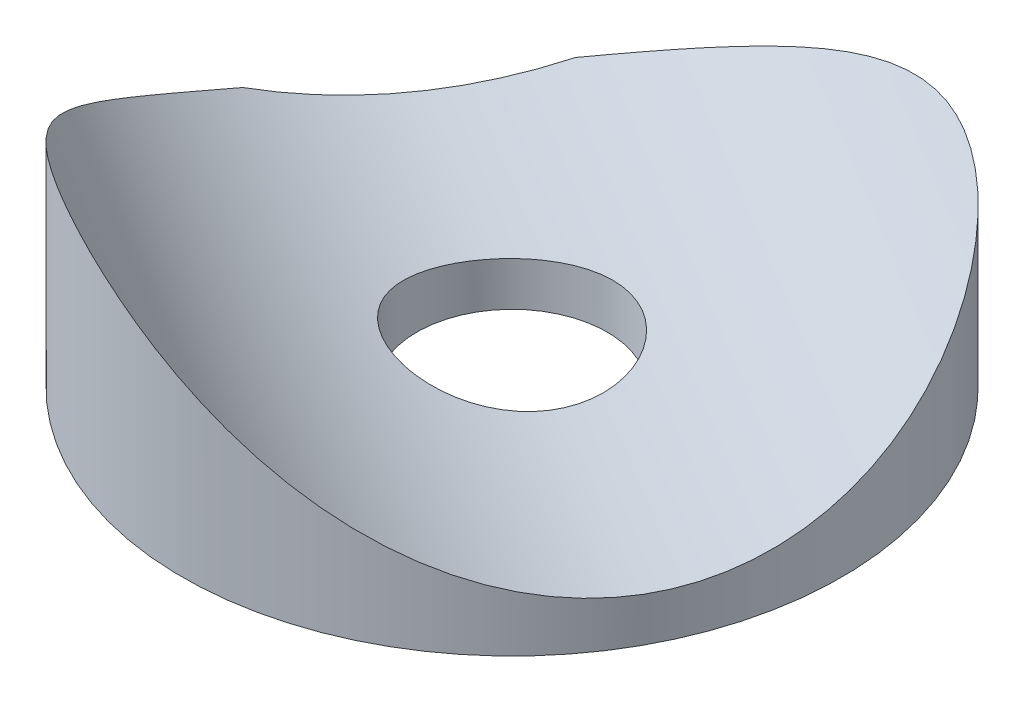
ISO-10303-21;
HEADER;
FILE_DESCRIPTION(('STEP AP214'),'2;1');
FILE_NAME('part.step','',(''),(''),'','','');
FILE_SCHEMA(('AUTOMOTIVE_DESIGN { 1 0 10303 214 1 1 1 1 }'));
ENDSEC;
DATA;
#1=APPLICATION_CONTEXT('core data for automotive mechanical design processes');
#2=APPLICATION_PROTOCOL_DEFINITION('international standard','automotive_design',2000,#1);
#3=PRODUCT_CONTEXT('',#1,'mechanical');
#4=PRODUCT('Part','Part','',(#3));
#5=PRODUCT_RELATED_PRODUCT_CATEGORY('part','',(#4));
#6=PRODUCT_DEFINITION_FORMATION('','',#4);
#7=PRODUCT_DEFINITION_CONTEXT('part definition',#1,'design');
#8=PRODUCT_DEFINITION('design','',#6,#7);
#9=PRODUCT_DEFINITION_SHAPE('','',#8);
#10=(LENGTH_UNIT() NAMED_UNIT(*) SI_UNIT(.MILLI.,.METRE.));
#11=(NAMED_UNIT(*) PLANE_ANGLE_UNIT() SI_UNIT($,.RADIAN.));
#12=(NAMED_UNIT(*) SI_UNIT($,.STERADIAN.) SOLID_ANGLE_UNIT());
#13=UNCERTAINTY_MEASURE_WITH_UNIT(LENGTH_MEASURE(1.E-05),#10,'distance_accuracy_value','');
#14=(GEOMETRIC_REPRESENTATION_CONTEXT(3) GLOBAL_UNCERTAINTY_ASSIGNED_CONTEXT((#13)) GLOBAL_UNIT_ASSIGNED_CONTEXT((#10,
#11,#12)) REPRESENTATION_CONTEXT('',''));
#15=CARTESIAN_POINT('',(0.,0.,0.));
#16=DIRECTION('',(0.,0.,1.));
#17=DIRECTION('',(1.,0.,0.));
#18=AXIS2_PLACEMENT_3D('',#15,#16,#17);
#19=CARTESIAN_POINT('',(0.,1.,0.));
#20=DIRECTION('',(0.,-1.,0.));
#21=DIRECTION('',(0.,0.,-1.));
#22=AXIS2_PLACEMENT_3D('',#19,#20,#21);
#23=CYLINDRICAL_SURFACE('',#22,9.525);
#24=CARTESIAN_POINT('',(0.,0.,0.));
#25=DIRECTION('',(0.,1.,0.));
#26=DIRECTION('',(0.,0.,1.));
#27=AXIS2_PLACEMENT_3D('',#24,#25,#26);
#28=CIRCLE('',#27,9.525);
#29=CARTESIAN_POINT('',(-9.38893175942103,0.,-1.6042398252553));
#30=VERTEX_POINT('',#29);
#31=CARTESIAN_POINT('',(-5.7570076227299,0.,-7.58831260767701));
#32=VERTEX_POINT('',#31);
#33=EDGE_CURVE('E48',#30,#32,#28,.T.);
#34=ORIENTED_EDGE('',*,*,#33,.T.);
#35=DIRECTION('',(0.,1.,0.));
#36=VECTOR('',#35,1.);
#37=CARTESIAN_POINT('',(-5.7570076227299,0.,-7.58831260767701));
#38=LINE('',#37,#36);
#39=CARTESIAN_POINT('',(-5.75700762272995,1.57357757625915,-7.58831260767704));
#40=VERTEX_POINT('',#39);
#41=EDGE_CURVE('E65',#32,#40,#38,.T.);
#42=ORIENTED_EDGE('',*,*,#41,.T.);
#43=CARTESIAN_POINT('',(0.,3.6506814174177,-9.525));
#44=CARTESIAN_POINT('',(0.22237909048093,3.733452678494,-9.52500034706546));
#45=CARTESIAN_POINT('',(0.445378660546458,3.81461579377186,-9.5172159876102));
#46=CARTESIAN_POINT('',(0.892178109928734,3.97181857019409,-9.48576909084998));
#47=CARTESIAN_POINT('',(1.11597827185463,4.04785618425951,-9.46210025029206));
#48=CARTESIAN_POINT('',(1.56398647428124,4.19276272755659,-9.39844823182042));
#49=CARTESIAN_POINT('',(1.78819463015935,4.26162093698106,-9.35844108445317));
#50=CARTESIAN_POINT('',(2.2356623762194,4.38970656675308,-9.26173815261623));
#51=CARTESIAN_POINT('',(2.45892242675594,4.44893935148342,-9.20505171360457));
#52=CARTESIAN_POINT('',(2.90603365144995,4.55609576120154,-9.07389118642197));
#53=CARTESIAN_POINT('',(3.12985989098693,4.60387547115162,-8.99921222798601));
#54=CARTESIAN_POINT('',(3.57364407860214,4.68488536422006,-8.8323758822077));
#55=CARTESIAN_POINT('',(3.79360215508769,4.71811603118604,-8.74021907626035));
#56=CARTESIAN_POINT('',(4.2270093763011,4.76812593471324,-8.53902543880597));
#57=CARTESIAN_POINT('',(4.44047224128782,4.78494257685117,-8.43002764612762));
#58=CARTESIAN_POINT('',(4.8590394857365,4.8012297593004,-8.19590335479795));
#59=CARTESIAN_POINT('',(5.06414518641639,4.80070305222886,-8.07077941871725));
#60=CARTESIAN_POINT('',(5.4333607061631,4.78375549217292,-7.82595558546464));
#61=CARTESIAN_POINT('',(5.59896346666445,4.76976247064538,-7.70832159450795));
#62=CARTESIAN_POINT('',(5.92147144927301,4.72996177680787,-7.46343108435357));
#63=CARTESIAN_POINT('',(6.07837402256478,4.70415052828175,-7.33617166222143));
#64=CARTESIAN_POINT('',(6.38271610075956,4.64172229189515,-7.07298282388013));
#65=CARTESIAN_POINT('',(6.53014555361239,4.60509404922601,-6.93704449353435));
#66=CARTESIAN_POINT('',(6.81488219768711,4.52235744531086,-6.65754024993715));
#67=CARTESIAN_POINT('',(6.95218337122211,4.47624350883152,-6.51396988791492));
#68=CARTESIAN_POINT('',(7.25811511525602,4.36012987577854,-6.17357628743771));
#69=CARTESIAN_POINT('',(7.42289578436665,4.28719080892501,-5.97428832987823));
#70=CARTESIAN_POINT('',(7.73401212509885,4.13079433482259,-5.56567019095694));
#71=CARTESIAN_POINT('',(7.88034064314727,4.04733287314991,-5.35633615806365));
#72=CARTESIAN_POINT('',(8.15470981056013,3.87295689197122,-4.9285876165221));
#73=CARTESIAN_POINT('',(8.28272692697576,3.78203301401353,-4.71016188062345));
#74=CARTESIAN_POINT('',(8.52030625242976,3.59569475789344,-4.26539247396375));
#75=CARTESIAN_POINT('',(8.6298699560098,3.50028074418864,-4.03904944621897));
#76=CARTESIAN_POINT('',(8.83284627685265,3.30530463670498,-3.57383929429456));
#77=CARTESIAN_POINT('',(8.92582974360464,3.20569760788886,-3.33480387967768));
#78=CARTESIAN_POINT('',(9.09229502749264,3.00695749961978,-2.84982866665909));
#79=CARTESIAN_POINT('',(9.16577592138118,2.9078244428226,-2.60388854199917));
#80=CARTESIAN_POINT('',(9.29280555673236,2.71244077825675,-2.10602333245941));
#81=CARTESIAN_POINT('',(9.34637031520592,2.61618791171262,-1.8541032310461));
#82=CARTESIAN_POINT('',(9.43310199315825,2.42870734073609,-1.34494660046395));
#83=CARTESIAN_POINT('',(9.46627168692592,2.33747895437414,-1.08771079929883));
#84=CARTESIAN_POINT('',(9.50955206491735,2.16995418710134,-0.591915382603216));
#85=CARTESIAN_POINT('',(9.52144302627834,2.0930508012756,-0.353716641702909));
#86=CARTESIAN_POINT('',(9.52718529060547,1.94684829681261,0.125113773500827));
#87=CARTESIAN_POINT('',(9.52104599018335,1.87754523673548,0.365744115413936));
#88=CARTESIAN_POINT('',(9.49023009219835,1.74807562735335,0.84829118917853));
#89=CARTESIAN_POINT('',(9.4655541630631,1.68790874869326,1.09020787433238));
#90=CARTESIAN_POINT('',(9.39725359476562,1.57821699516667,1.57380854666545));
#91=CARTESIAN_POINT('',(9.35362900245173,1.52869209398956,1.81549253441851));
#92=CARTESIAN_POINT('',(9.2468116506475,1.44134470549369,2.29864295079791));
#93=CARTESIAN_POINT('',(9.18347392745661,1.40361320401421,2.54009401935461));
#94=CARTESIAN_POINT('',(9.03741073939083,1.34158179009402,3.01885030104931));
#95=CARTESIAN_POINT('',(8.95468511569913,1.31728198768513,3.25615548020898));
#96=CARTESIAN_POINT('',(8.77034965671094,1.28305270781928,3.72422003591037));
#97=CARTESIAN_POINT('',(8.66875202768035,1.27311397800467,3.95498353298807));
#98=CARTESIAN_POINT('',(8.44749114693444,1.26813613835543,4.40783414961075));
#99=CARTESIAN_POINT('',(8.32783011991501,1.27309519512261,4.62992233337697));
#100=CARTESIAN_POINT('',(8.08789173108999,1.29645824482825,5.03587196191596));
#101=CARTESIAN_POINT('',(7.96960287315102,1.31308414836339,5.22101768057337));
#102=CARTESIAN_POINT('',(7.72123078388721,1.35761606789838,5.58177080894418));
#103=CARTESIAN_POINT('',(7.59114874785823,1.38552094170908,5.7573791824353));
#104=CARTESIAN_POINT('',(7.32034519395255,1.45220339144303,6.09799295159335));
#105=CARTESIAN_POINT('',(7.17962354409064,1.4909811022608,6.26299821568092));
#106=CARTESIAN_POINT('',(6.88876339677229,1.5788067465418,6.58157218907568));
#107=CARTESIAN_POINT('',(6.73862447338407,1.62785514477063,6.73514038040992));
#108=CARTESIAN_POINT('',(6.42970367468719,1.73562913110676,7.03067358853535));
#109=CARTESIAN_POINT('',(6.27089719828316,1.79438333781747,7.17260237568541));
#110=CARTESIAN_POINT('',(5.94618463755025,1.92062333472038,7.44401185020723));
#111=CARTESIAN_POINT('',(5.78027582377378,1.98811250231212,7.57348768867714));
#112=CARTESIAN_POINT('',(5.44251585252767,2.13087691541917,7.81973962082222));
#113=CARTESIAN_POINT('',(5.27066481873349,2.206151998951,7.93651597860235));
#114=CARTESIAN_POINT('',(4.92197812629002,2.3635397586242,8.15735023810444));
#115=CARTESIAN_POINT('',(4.74514151071915,2.44565375340315,8.26140567746623));
#116=CARTESIAN_POINT('',(4.31381915110247,2.65071186421033,8.49701730634487));
#117=CARTESIAN_POINT('',(4.05727813244352,2.77657146242391,8.62231021389749));
#118=CARTESIAN_POINT('',(3.53791345362358,3.03730293284649,8.84810949511277));
#119=CARTESIAN_POINT('',(3.27508761733146,3.17217795655747,8.94860714295283));
#120=CARTESIAN_POINT('',(2.74396155309675,3.44858295781127,9.1255054949139));
#121=CARTESIAN_POINT('',(2.47564897446842,3.59012917296496,9.20184350199571));
#122=CARTESIAN_POINT('',(1.93525003180599,3.87676105424118,9.33046531137728));
#123=CARTESIAN_POINT('',(1.66316412956847,4.02184628886322,9.38275203088317));
#124=CARTESIAN_POINT('',(1.11176365251241,4.31474926070324,9.46405917404022));
#125=CARTESIAN_POINT('',(0.832401614462931,4.46257580785578,9.49272618123314));
#126=CARTESIAN_POINT('',(0.270620806169236,4.75535713873259,9.5253137168947));
#127=CARTESIAN_POINT('',(-0.011798853198519,4.90031105044458,9.52922684243904));
#128=CARTESIAN_POINT('',(-0.578823309456278,5.18269507404288,9.51161520991849));
#129=CARTESIAN_POINT('',(-0.863421125866201,5.32014261845171,9.49015226378016));
#130=CARTESIAN_POINT('',(-1.43497221225356,5.58237916760316,9.42068822496332));
#131=CARTESIAN_POINT('',(-1.72192343677743,5.70717811797209,9.37270817737066));
#132=CARTESIAN_POINT('',(-2.33982186606084,5.95413079638297,9.23929042182607));
#133=CARTESIAN_POINT('',(-2.67110514088122,6.07326698198325,9.149424026913));
#134=CARTESIAN_POINT('',(-3.16652150547122,6.22295675517261,8.98493345593029));
#135=CARTESIAN_POINT('',(-3.33131545477155,6.26800018760398,8.92519722094702));
#136=CARTESIAN_POINT('',(-3.65961344271974,6.3467944312253,8.7956778474335));
#137=CARTESIAN_POINT('',(-3.82311810864075,6.38055111325733,8.72589995920701));
#138=CARTESIAN_POINT('',(-4.14960287525218,6.4356233390429,8.57549375030731));
#139=CARTESIAN_POINT('',(-4.31255472816974,6.45678952892885,8.49474860895594));
#140=CARTESIAN_POINT('',(-4.63450087969504,6.48497913175298,8.32347650404684));
#141=CARTESIAN_POINT('',(-4.79349547894325,6.49200362232337,8.2329502863851));
#142=CARTESIAN_POINT('',(-5.10599248219772,6.49152681859125,8.04287958822367));
#143=CARTESIAN_POINT('',(-5.25949451812687,6.48402455264656,7.94333450490919));
#144=CARTESIAN_POINT('',(-5.55960807489611,6.4549041358305,7.73625474625245));
#145=CARTESIAN_POINT('',(-5.70621886425581,6.43328449006229,7.62871922586736));
#146=CARTESIAN_POINT('',(-6.00175711490564,6.37500136712914,7.39878778002419));
#147=CARTESIAN_POINT('',(-6.15009319686921,6.33736798617528,7.27587930902499));
#148=CARTESIAN_POINT('',(-6.4368579960583,6.24907351428848,7.02346192329461));
#149=CARTESIAN_POINT('',(-6.57528544738272,6.19841076254069,6.89395216880626));
#150=CARTESIAN_POINT('',(-6.97591710569875,6.02984978313954,6.49645185009399));
#151=CARTESIAN_POINT('',(-7.22290265355389,5.89550558627119,6.21993774392456));
#152=CARTESIAN_POINT('',(-7.62202096296865,5.63517184863642,5.71900346110004));
#153=CARTESIAN_POINT('',(-7.78266855256773,5.51497057559286,5.49808727197862));
#154=CARTESIAN_POINT('',(-8.08224298694304,5.26415387534452,5.04738956838241));
#155=CARTESIAN_POINT('',(-8.22115853132667,5.13353308306772,4.8176035186019));
#156=CARTESIAN_POINT('',(-8.47806602595574,4.86617462093962,4.34964248978896));
#157=CARTESIAN_POINT('',(-8.5960310256615,4.72942935159897,4.11145717113467));
#158=CARTESIAN_POINT('',(-8.81125052566926,4.45350434616347,3.62734435139673));
#159=CARTESIAN_POINT('',(-8.90850853916985,4.31432502737856,3.38141817178675));
#160=CARTESIAN_POINT('',(-9.08616050605041,4.03035752776154,2.87114292225067));
#161=CARTESIAN_POINT('',(-9.16562839334625,3.88559090303486,2.60645882743807));
#162=CARTESIAN_POINT('',(-9.30161662854024,3.59952186340864,2.06936851111632));
#163=CARTESIAN_POINT('',(-9.35813427298582,3.45821985846934,1.79696138390389));
#164=CARTESIAN_POINT('',(-9.44732893718526,3.18206811661624,1.24557927539444));
#165=CARTESIAN_POINT('',(-9.48004333216279,3.04720857641793,0.966615303675754));
#166=CARTESIAN_POINT('',(-9.52067353055724,2.78640578788668,0.402785560085591));
#167=CARTESIAN_POINT('',(-9.52859584268432,2.6604602078436,0.117921356984621));
#168=CARTESIAN_POINT('',(-9.51944687371087,2.44482112624523,-0.397273669881496));
#169=CARTESIAN_POINT('',(-9.50717023010757,2.35299156531163,-0.62680128201583));
#170=CARTESIAN_POINT('',(-9.46553000057533,2.17801120293598,-1.0875924783347));
#171=CARTESIAN_POINT('',(-9.43617008765357,2.09485854043875,-1.31885567880982));
#172=CARTESIAN_POINT('',(-9.35979851702589,1.93858211671128,-1.78179977177871));
#173=CARTESIAN_POINT('',(-9.31279247294793,1.8654551761647,-2.01348050814312));
#174=CARTESIAN_POINT('',(-9.20068933572693,1.73048167956561,-2.47578349833277));
#175=CARTESIAN_POINT('',(-9.13559202468938,1.6686352593926,-2.70640573937529));
#176=CARTESIAN_POINT('',(-8.98653717823234,1.55697423821467,-3.16649271546125));
#177=CARTESIAN_POINT('',(-8.90244182756762,1.5072533730385,-3.39593579018033));
#178=CARTESIAN_POINT('',(-8.71577157367619,1.42144072912138,-3.84982549130898));
#179=CARTESIAN_POINT('',(-8.61319659163794,1.38534900850775,-4.07427209640511));
#180=CARTESIAN_POINT('',(-8.39010466963368,1.32751107740255,-4.5158528291067));
#181=CARTESIAN_POINT('',(-8.26959675782085,1.30575767817537,-4.73299056922387));
#182=CARTESIAN_POINT('',(-8.01148304619633,1.27690865794464,-5.15786078033715));
#183=CARTESIAN_POINT('',(-7.87387910970797,1.26981144102333,-5.36559427295604));
#184=CARTESIAN_POINT('',(-7.60016438671879,1.27017340437914,-5.74554199580838));
#185=CARTESIAN_POINT('',(-7.46582580488146,1.27600035018457,-5.91904073385996));
#186=CARTESIAN_POINT('',(-7.18587908547049,1.29865651167408,-6.25593539777965));
#187=CARTESIAN_POINT('',(-7.04027087086926,1.31548580256471,-6.41933125458115));
#188=CARTESIAN_POINT('',(-6.73895516765493,1.35961607103937,-6.73496195272317));
#189=CARTESIAN_POINT('',(-6.58324887222272,1.38691581330985,-6.88719810817279));
#190=CARTESIAN_POINT('',(-6.26291075985467,1.45127060025826,-7.17973768851085));
#191=CARTESIAN_POINT('',(-6.09827857538008,1.4883260468866,-7.32004062141648));
#192=CARTESIAN_POINT('',(-5.75956176127382,1.57175680441154,-7.58949079731291));
#193=CARTESIAN_POINT('',(-5.5853984499,1.61822247455026,-7.71851104143273));
#194=CARTESIAN_POINT('',(-5.23029636235126,1.7192460828921,-7.96342907327246));
#195=CARTESIAN_POINT('',(-5.04935535019025,1.77380670954109,-8.07932247875381));
#196=CARTESIAN_POINT('',(-4.49781512565411,1.94812092158115,-8.40702333795898));
#197=CARTESIAN_POINT('',(-4.11850349712635,2.07850562191335,-8.5988476697629));
#198=CARTESIAN_POINT('',(-3.28577303834973,2.37978263207911,-8.95345572505555));
#199=CARTESIAN_POINT('',(-2.82981657267748,2.55381879630248,-9.10747221903123));
#200=CARTESIAN_POINT('',(-1.90493711922323,2.91349275957165,-9.34475279673453));
#201=CARTESIAN_POINT('',(-1.43603200442324,3.09911497295632,-9.42810982016988));
#202=CARTESIAN_POINT('',(-0.803628316371815,3.34503936231751,-9.49239452782719));
#203=CARTESIAN_POINT('',(-0.643485696687926,3.40694021958764,-9.50459870594557));
#204=CARTESIAN_POINT('',(-0.322337697838755,3.52973680950557,-9.52090221200377));
#205=CARTESIAN_POINT('',(-0.161332135828518,3.59063231700191,-9.52499974821008));
#206=CARTESIAN_POINT('',(0.,3.6506814174177,-9.525));
#207=B_SPLINE_CURVE_WITH_KNOTS('',3,(#43,#44,#45,#46,#47,#48,#49,#50,#51,#52,#53,#54,#55,#56,
#57,#58,#59,#60,#61,#62,#63,#64,#65,#66,#67,#68,#69,#70,#71,#72,#73,#74,#75,#76,#77,#78,#79,#80,
#81,#82,#83,#84,#85,#86,#87,#88,#89,#90,#91,#92,#93,#94,#95,#96,#97,#98,#99,#100,#101,#102,#103,
#104,#105,#106,#107,#108,#109,#110,#111,#112,#113,#114,#115,#116,#117,#118,#119,#120,#121,#122,
#123,#124,#125,#126,#127,#128,#129,#130,#131,#132,#133,#134,#135,#136,#137,#138,#139,#140,#141,
#142,#143,#144,#145,#146,#147,#148,#149,#150,#151,#152,#153,#154,#155,#156,#157,#158,#159,#160,
#161,#162,#163,#164,#165,#166,#167,#168,#169,#170,#171,#172,#173,#174,#175,#176,#177,#178,#179,
#180,#181,#182,#183,#184,#185,#186,#187,#188,#189,#190,#191,#192,#193,#194,#195,#196,#197,#198,
#199,#200,#201,#202,#203,#204,#205,#206),.UNSPECIFIED.,.T.,.F.,(4,2,2,2,2,2,2,2,2,2,2,2,2,2,2,2,
2,2,2,2,2,2,2,2,2,2,2,2,2,2,2,2,2,2,2,2,2,2,2,2,2,2,2,2,2,2,2,2,2,2,2,2,2,2,2,2,2,2,2,2,2,2,2,2,
2,2,2,2,2,2,2,2,2,2,2,2,2,2,2,2,2,4),(0.,0.711739913287785,1.42376242513394,2.13683329860379,
2.8495053946419,3.57071139363043,4.29189340613907,5.01142806802801,5.73084853087266,
6.34092818603504,6.9511925744993,7.56209417827987,8.17335587179448,8.97821256023193,
9.78338032431958,10.589573729828,11.3957018103118,12.2203600446609,13.0450573111866,
13.8690898953613,14.6930103636621,15.4440451163495,16.1946885308786,16.9453048786343,
17.6959193705893,18.4521895204847,19.2084658656157,19.964254749667,20.7199506262632,
21.3801564245815,22.0402953824853,22.7004425308065,23.3606195583378,24.0227791200759,
24.6851954770067,25.34759805535,26.0101286511642,26.9448330284587,27.8798658745187,
28.8173057101832,29.7546318127764,30.7057405116944,31.6571336368315,32.6062140915713,
33.5545423955941,34.6406244116804,35.1830479982071,35.7251890007089,36.2736391037909,
36.8220474120462,37.3704924026162,37.9189954777367,38.5069367258531,39.094952954256,
40.2731598472556,41.1674419735952,42.0621875808238,42.9580759706254,43.8538122404433,
44.7888112763375,45.7239204196849,46.657558092411,47.5909506349861,48.3328308921448,
49.0745516994302,49.8160367484611,50.5575307284595,51.3045869617216,52.0516463810888,
52.7983309653706,53.5449342385703,54.2026611493469,54.8603925560635,55.5180463868782,
56.1757273183107,56.8400514900358,57.5045967888469,58.8337057988563,60.3636372532852,
61.8915532241958,62.4077939802412,62.9241488233013),.UNSPECIFIED.);
#208=CARTESIAN_POINT('',(-9.38893175942102,1.99861299629491,-1.60423982525534));
#209=VERTEX_POINT('',#208);
#210=EDGE_CURVE('E73',#40,#209,#207,.T.);
#211=ORIENTED_EDGE('',*,*,#210,.T.);
#212=DIRECTION('',(0.,1.,0.));
#213=VECTOR('',#212,1.);
#214=CARTESIAN_POINT('',(-9.38893175942103,0.,-1.6042398252553));
#215=LINE('',#214,#213);
#216=EDGE_CURVE('E54',#30,#209,#215,.T.);
#217=ORIENTED_EDGE('',*,*,#216,.F.);
#218=EDGE_LOOP('',(#34,#42,#211,#217));
#219=FACE_BOUND('',#218,.T.);
#220=ADVANCED_FACE('F41',(#219),#23,.T.);
#221=CARTESIAN_POINT('',(0.,0.,0.));
#222=DIRECTION('',(0.,1.,0.));
#223=DIRECTION('',(0.,0.,1.));
#224=AXIS2_PLACEMENT_3D('',#221,#222,#223);
#225=PLANE('',#224);
#226=CARTESIAN_POINT('',(0.,0.,0.));
#227=DIRECTION('',(0.,1.,0.));
#228=DIRECTION('',(0.,0.,1.));
#229=AXIS2_PLACEMENT_3D('',#226,#227,#228);
#230=CIRCLE('',#229,2.75);
#231=CARTESIAN_POINT('',(0.,0.,2.75));
#232=VERTEX_POINT('',#231);
#233=EDGE_CURVE('E76',#232,#232,#230,.T.);
#234=ORIENTED_EDGE('',*,*,#233,.T.);
#235=EDGE_LOOP('',(#234));
#236=FACE_BOUND('',#235,.T.);
#237=ORIENTED_EDGE('',*,*,#33,.F.);
#238=DIRECTION('',(0.51884630524159,0.,-0.854867540345959));
#239=VECTOR('',#238,1.);
#240=CARTESIAN_POINT('',(-5.7570076227299,0.,-7.58831260767701));
#241=LINE('',#240,#239);
#242=EDGE_CURVE('E63',#30,#32,#241,.T.);
#243=ORIENTED_EDGE('',*,*,#242,.T.);
#244=EDGE_LOOP('',(#237,#243));
#245=FACE_BOUND('',#244,.T.);
#246=ADVANCED_FACE('F75',(#236,#245),#225,.F.);
#247=CARTESIAN_POINT('',(0.,1.,0.));
#248=DIRECTION('',(0.,1.,0.));
#249=DIRECTION('',(0.,0.,1.));
#250=AXIS2_PLACEMENT_3D('',#247,#248,#249);
#251=CYLINDRICAL_SURFACE('',#250,2.74999999999999);
#252=ORIENTED_EDGE('',*,*,#233,.F.);
#253=EDGE_LOOP('',(#252));
#254=FACE_BOUND('',#253,.T.);
#255=CARTESIAN_POINT('',(-1.88037903896943,1.26999999999996,-2.00665759124929));
#256=CARTESIAN_POINT('',(-1.99121996867132,1.270002778839,-1.90278497504507));
#257=CARTESIAN_POINT('',(-2.0934775262432,1.27255321242408,-1.78966378725376));
#258=CARTESIAN_POINT('',(-2.27785776793284,1.28319188497578,-1.54821395874507));
#259=CARTESIAN_POINT('',(-2.3599683330257,1.29128344605941,-1.41987623332121));
#260=CARTESIAN_POINT('',(-2.50172417963238,1.31282917856013,-1.15188308759369));
#261=CARTESIAN_POINT('',(-2.56138613875666,1.32627935357752,-1.01223616327404));
#262=CARTESIAN_POINT('',(-2.65686510285008,1.35779292254568,-0.72553656473311));
#263=CARTESIAN_POINT('',(-2.69268268692463,1.37585620444375,-0.578484070463303));
#264=CARTESIAN_POINT('',(-2.74002000986761,1.41557934546685,-0.279271378530394));
#265=CARTESIAN_POINT('',(-2.75126062208944,1.43727753782018,-0.127072241843986));
#266=CARTESIAN_POINT('',(-2.74851420162702,1.48246240935837,0.176841373549707));
#267=CARTESIAN_POINT('',(-2.73452271895768,1.50594940332035,0.328555762038472));
#268=CARTESIAN_POINT('',(-2.68106511591996,1.5533872498818,0.631351791057578));
#269=CARTESIAN_POINT('',(-2.6409749603704,1.57733513610569,0.78232414259364));
#270=CARTESIAN_POINT('',(-2.53570152761301,1.62294587594623,1.0756372708196));
#271=CARTESIAN_POINT('',(-2.47051757178177,1.64460866774581,1.21797781395494));
#272=CARTESIAN_POINT('',(-2.31668888993527,1.68354738759117,1.48990962666868));
#273=CARTESIAN_POINT('',(-2.22806210780634,1.70082665119504,1.61951054393326));
#274=CARTESIAN_POINT('',(-2.0296563703495,1.72923219222358,1.86213180466105));
#275=CARTESIAN_POINT('',(-1.91988283579377,1.74036004368249,1.97515638426356));
#276=CARTESIAN_POINT('',(-1.68621022991463,1.75501229687838,2.17768822968697));
#277=CARTESIAN_POINT('',(-1.56288161913392,1.75877057664314,2.26783694276768));
#278=CARTESIAN_POINT('',(-1.30301411121616,1.75899610986985,2.4264832145838));
#279=CARTESIAN_POINT('',(-1.16647701028338,1.755464353369,2.49498371183942));
#280=CARTESIAN_POINT('',(-0.887385484739972,1.7416416291788,2.60713933853786));
#281=CARTESIAN_POINT('',(-0.745028440679476,1.73150044926787,2.65130594028974));
#282=CARTESIAN_POINT('',(-0.455551160373396,1.70560467168279,2.71605921385519));
#283=CARTESIAN_POINT('',(-0.308430449736793,1.68984951336634,2.73664352974819));
#284=CARTESIAN_POINT('',(-0.0105875017590696,1.653862176015,2.7540973237536));
#285=CARTESIAN_POINT('',(0.140151159954187,1.63355287973673,2.75052301429741));
#286=CARTESIAN_POINT('',(0.438690473500498,1.59046395033303,2.71893239206746));
#287=CARTESIAN_POINT('',(0.586490543824859,1.56768383391024,2.69091128987496));
#288=CARTESIAN_POINT('',(0.880369881238066,1.52080549677268,2.60987598424335));
#289=CARTESIAN_POINT('',(1.0262233111387,1.49668872692737,2.5560513542639));
#290=CARTESIAN_POINT('',(1.30700242615022,1.44993925728724,2.4245166589356));
#291=CARTESIAN_POINT('',(1.4419275035282,1.42730664004042,2.34680526637883));
#292=CARTESIAN_POINT('',(1.69796813411077,1.38521215783056,2.16884047680159));
#293=CARTESIAN_POINT('',(1.81898391621725,1.36577281766306,2.06843789938158));
#294=CARTESIAN_POINT('',(2.04247581518455,1.33172534062378,1.84808208922438));
#295=CARTESIAN_POINT('',(2.14495491801487,1.31711642533152,1.72813201121238));
#296=CARTESIAN_POINT('',(2.32601031291655,1.29390837083171,1.47506686869883));
#297=CARTESIAN_POINT('',(2.4050831642252,1.28517845500204,1.34231903258431));
#298=CARTESIAN_POINT('',(2.53996904205355,1.27342801785094,1.06526455960796));
#299=CARTESIAN_POINT('',(2.59578451902794,1.2704068949183,0.920959142392605));
#300=CARTESIAN_POINT('',(2.68169212826901,1.26967684605551,0.627668493760348));
#301=CARTESIAN_POINT('',(2.71222259451842,1.27187472735306,0.478811517762664));
#302=CARTESIAN_POINT('',(2.74839102205555,1.28047415902683,0.178226537162357));
#303=CARTESIAN_POINT('',(2.75402778309773,1.28687591207489,0.0264983944811514));
#304=CARTESIAN_POINT('',(2.74027243315246,1.30263188945514,-0.276831360735608));
#305=CARTESIAN_POINT('',(2.72068711001412,1.31200848594048,-0.428422987758454));
#306=CARTESIAN_POINT('',(2.65675100223248,1.3321141686554,-0.72620224348999));
#307=CARTESIAN_POINT('',(2.61239783097387,1.3428433851455,-0.872389349974664));
#308=CARTESIAN_POINT('',(2.49925364871194,1.36416818351275,-1.15764135897524));
#309=CARTESIAN_POINT('',(2.43009481356494,1.37475912255376,-1.2965609007379));
#310=CARTESIAN_POINT('',(2.26935725719663,1.39402530818336,-1.56091181295002));
#311=CARTESIAN_POINT('',(2.17777889276329,1.40270058525391,-1.68634339800326));
#312=CARTESIAN_POINT('',(1.97481811386944,1.41683114749096,-1.92003126352785));
#313=CARTESIAN_POINT('',(1.86345345169679,1.42228930026808,-2.02830277663278));
#314=CARTESIAN_POINT('',(1.62403529729406,1.4291817029534,-2.22462824809025));
#315=CARTESIAN_POINT('',(1.49598316910451,1.43061628153463,-2.31268385727639));
#316=CARTESIAN_POINT('',(1.22846423446148,1.4292564091716,-2.46511788775265));
#317=CARTESIAN_POINT('',(1.08914528201789,1.42651030014121,-2.52975642392669));
#318=CARTESIAN_POINT('',(0.801818753923587,1.41728048082295,-2.63495606463913));
#319=CARTESIAN_POINT('',(0.65381119305798,1.41079677689504,-2.67551721014788));
#320=CARTESIAN_POINT('',(0.35315369231322,1.39503134335961,-2.73151726481084));
#321=CARTESIAN_POINT('',(0.200500260595528,1.38574745998355,-2.74693677749394));
#322=CARTESIAN_POINT('',(-0.10518343643825,1.36574197050124,-2.75223723131753));
#323=CARTESIAN_POINT('',(-0.258213778758814,1.35502004163322,-2.74211243005815));
#324=CARTESIAN_POINT('',(-0.562283113552307,1.33361775410295,-2.69634216115097));
#325=CARTESIAN_POINT('',(-0.713276761857685,1.32293940721946,-2.66039453691311));
#326=CARTESIAN_POINT('',(-1.00711908617698,1.30349154706618,-2.56361142013377));
#327=CARTESIAN_POINT('',(-1.14997355498524,1.2947206633741,-2.50279388653757));
#328=CARTESIAN_POINT('',(-1.39442997067941,1.28216906465784,-2.3733808488263));
#329=CARTESIAN_POINT('',(-1.49834974427049,1.27772415745545,-2.309180239894));
#330=CARTESIAN_POINT('',(-1.6968176173073,1.27163856993722,-2.16752676486351));
#331=CARTESIAN_POINT('',(-1.79136612170486,1.2699977684004,-2.09007447179251));
#332=CARTESIAN_POINT('',(-1.88037903896943,1.26999999999996,-2.00665759124929));
#333=B_SPLINE_CURVE_WITH_KNOTS('',3,(#255,#256,#257,#258,#259,#260,#261,#262,#263,#264,#265,
#266,#267,#268,#269,#270,#271,#272,#273,#274,#275,#276,#277,#278,#279,#280,#281,#282,#283,#284,
#285,#286,#287,#288,#289,#290,#291,#292,#293,#294,#295,#296,#297,#298,#299,#300,#301,#302,#303,
#304,#305,#306,#307,#308,#309,#310,#311,#312,#313,#314,#315,#316,#317,#318,#319,#320,#321,#322,
#323,#324,#325,#326,#327,#328,#329,#330,#331,#332),.UNSPECIFIED.,.T.,.F.,(4,2,2,2,2,2,2,2,2,2,2,
2,2,2,2,2,2,2,2,2,2,2,2,2,2,2,2,2,2,2,2,2,2,2,2,2,2,2,4),(0.,0.455275388650713,
0.910823971483535,1.36603344490118,1.8212318622988,2.28157379425212,2.74199692101247,
3.21385469666497,3.68572523388524,4.15723562632184,4.62862531192896,5.08479621924214,
5.54090517947551,5.9870209211431,6.43318122683775,6.88755936914874,7.34202654956059,
7.81180892606514,8.28161740956635,8.75460939912721,9.22752512908183,9.6895389961204,
10.1515041719148,10.6052825021341,11.0590827109555,11.5163799934153,11.9737213483783,
12.4381454160919,12.902562093367,13.366564180469,13.8305283636063,14.2891682593014,
14.7478073745676,15.206800157331,15.6658961315499,16.1304534307014,16.59467585659,
16.9603092253916,17.3259267875282),.UNSPECIFIED.);
#334=CARTESIAN_POINT('',(-1.88037903896943,1.26999999999996,-2.00665759124929));
#335=VERTEX_POINT('',#334);
#336=EDGE_CURVE('E78',#335,#335,#333,.T.);
#337=ORIENTED_EDGE('',*,*,#336,.T.);
#338=EDGE_LOOP('',(#337));
#339=FACE_BOUND('',#338,.T.);
#340=ADVANCED_FACE('F97',(#254,#339),#251,.F.);
#341=CARTESIAN_POINT('',(620.263422385282,13.97,375.592207102217));
#342=DIRECTION('',(-0.854867540345959,0.,-0.51884630524159));
#343=DIRECTION('',(-0.51884630524159,0.,0.85486754034596));
#344=AXIS2_PLACEMENT_3D('',#341,#342,#343);
#345=CYLINDRICAL_SURFACE('',#344,12.7);
#346=CARTESIAN_POINT('',(-7.1891278572711,13.97,-5.228706130742));
#347=DIRECTION('',(0.854867540345959,0.,0.51884630524159));
#348=DIRECTION('',(0.51884630524159,0.,-0.854867540345959));
#349=AXIS2_PLACEMENT_3D('',#346,#347,#348);
#350=CIRCLE('',#349,12.7);
#351=EDGE_CURVE('E11',#209,#40,#350,.T.);
#352=ORIENTED_EDGE('',*,*,#351,.F.);
#353=ORIENTED_EDGE('',*,*,#210,.F.);
#354=EDGE_LOOP('',(#352,#353));
#355=FACE_BOUND('',#354,.T.);
#356=ORIENTED_EDGE('',*,*,#336,.F.);
#357=EDGE_LOOP('',(#356));
#358=FACE_BOUND('',#357,.T.);
#359=ADVANCED_FACE('F93',(#355,#358),#345,.F.);
#360=CARTESIAN_POINT('',(-5.7570076227299,0.,-7.58831260767701));
#361=DIRECTION('',(0.854867540345959,0.,0.51884630524159));
#362=DIRECTION('',(0.51884630524159,0.,-0.854867540345959));
#363=AXIS2_PLACEMENT_3D('',#360,#361,#362);
#364=PLANE('',#363);
#365=ORIENTED_EDGE('',*,*,#351,.T.);
#366=ORIENTED_EDGE('',*,*,#41,.F.);
#367=ORIENTED_EDGE('',*,*,#242,.F.);
#368=ORIENTED_EDGE('',*,*,#216,.T.);
#369=EDGE_LOOP('',(#365,#366,#367,#368));
#370=FACE_BOUND('',#369,.T.);
#371=ADVANCED_FACE('F64',(#370),#364,.F.);
#372=CLOSED_SHELL('',(#220,#246,#340,#359,#371));
#373=MANIFOLD_SOLID_BREP('B2',#372);
#374=ADVANCED_BREP_SHAPE_REPRESENTATION('',(#18,#373),#14);
#375=SHAPE_DEFINITION_REPRESENTATION(#9,#374);
ENDSEC;
END-ISO-10303-21;
